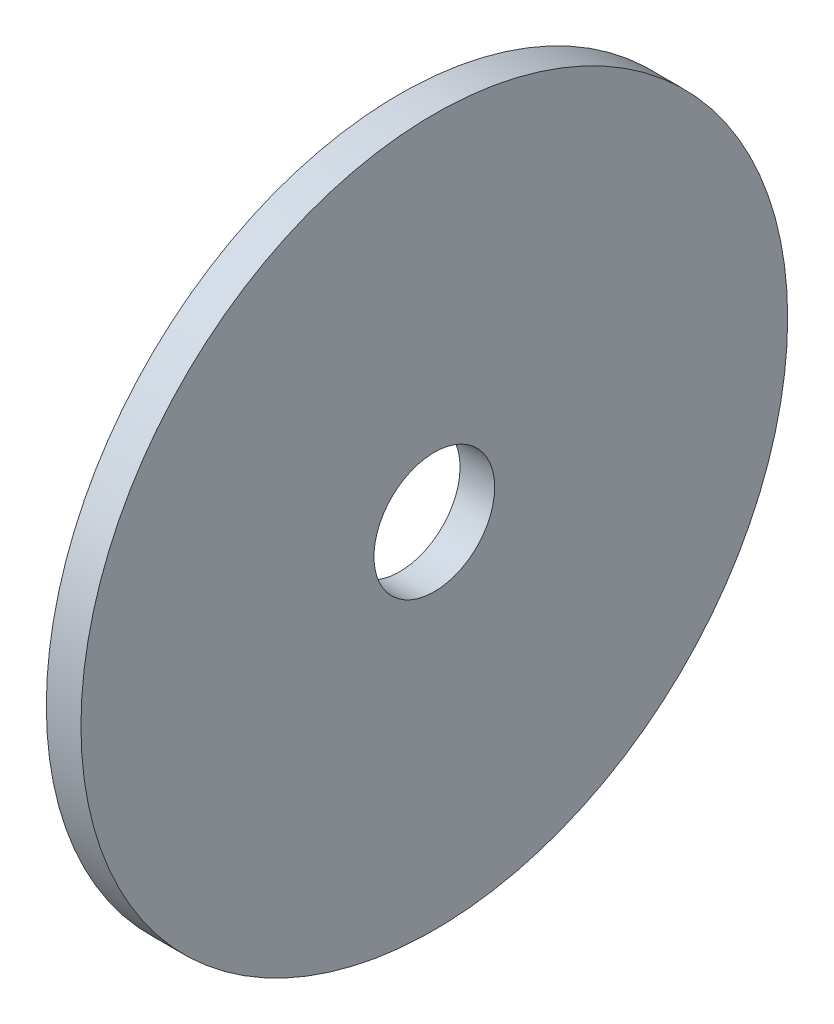
ISO-10303-21;
HEADER;
FILE_DESCRIPTION(('STEP AP214'),'2;1');
FILE_NAME('part.step','',(''),(''),'','','');
FILE_SCHEMA(('AUTOMOTIVE_DESIGN { 1 0 10303 214 1 1 1 1 }'));
ENDSEC;
DATA;
#1=APPLICATION_CONTEXT('core data for automotive mechanical design processes');
#2=APPLICATION_PROTOCOL_DEFINITION('international standard','automotive_design',2000,#1);
#3=PRODUCT_CONTEXT('',#1,'mechanical');
#4=PRODUCT('Part','Part','',(#3));
#5=PRODUCT_RELATED_PRODUCT_CATEGORY('part','',(#4));
#6=PRODUCT_DEFINITION_FORMATION('','',#4);
#7=PRODUCT_DEFINITION_CONTEXT('part definition',#1,'design');
#8=PRODUCT_DEFINITION('design','',#6,#7);
#9=PRODUCT_DEFINITION_SHAPE('','',#8);
#10=(LENGTH_UNIT() NAMED_UNIT(*) SI_UNIT(.MILLI.,.METRE.));
#11=(NAMED_UNIT(*) PLANE_ANGLE_UNIT() SI_UNIT($,.RADIAN.));
#12=(NAMED_UNIT(*) SI_UNIT($,.STERADIAN.) SOLID_ANGLE_UNIT());
#13=UNCERTAINTY_MEASURE_WITH_UNIT(LENGTH_MEASURE(1.E-05),#10,'distance_accuracy_value','');
#14=(GEOMETRIC_REPRESENTATION_CONTEXT(3) GLOBAL_UNCERTAINTY_ASSIGNED_CONTEXT((#13)) GLOBAL_UNIT_ASSIGNED_CONTEXT((#10,
#11,#12)) REPRESENTATION_CONTEXT('',''));
#15=CARTESIAN_POINT('',(0.,0.,0.));
#16=DIRECTION('',(0.,0.,1.));
#17=DIRECTION('',(1.,0.,0.));
#18=AXIS2_PLACEMENT_3D('',#15,#16,#17);
#19=CARTESIAN_POINT('',(542.417,0.,0.));
#20=DIRECTION('',(1.,0.,0.));
#21=DIRECTION('',(0.,0.,-1.));
#22=AXIS2_PLACEMENT_3D('',#19,#20,#21);
#23=PLANE('',#22);
#24=CARTESIAN_POINT('',(542.417,0.,0.));
#25=DIRECTION('',(1.,0.,0.));
#26=DIRECTION('',(0.,0.,-1.));
#27=AXIS2_PLACEMENT_3D('',#24,#25,#26);
#28=CIRCLE('',#27,9.525);
#29=CARTESIAN_POINT('',(542.417,0.,-9.525));
#30=VERTEX_POINT('',#29);
#31=EDGE_CURVE('E49',#30,#30,#28,.T.);
#32=ORIENTED_EDGE('',*,*,#31,.F.);
#33=EDGE_LOOP('',(#32));
#34=FACE_BOUND('',#33,.T.);
#35=CARTESIAN_POINT('',(542.417,0.,0.));
#36=DIRECTION('',(1.,0.,0.));
#37=DIRECTION('',(0.,0.,-1.));
#38=AXIS2_PLACEMENT_3D('',#35,#36,#37);
#39=CIRCLE('',#38,55.7566922304204);
#40=CARTESIAN_POINT('',(542.417,0.,-55.7566922304204));
#41=VERTEX_POINT('',#40);
#42=EDGE_CURVE('E60',#41,#41,#39,.T.);
#43=ORIENTED_EDGE('',*,*,#42,.T.);
#44=EDGE_LOOP('',(#43));
#45=FACE_BOUND('',#44,.T.);
#46=ADVANCED_FACE('F46',(#34,#45),#23,.T.);
#47=CARTESIAN_POINT('',(536.956,0.,0.));
#48=DIRECTION('',(1.,0.,0.));
#49=DIRECTION('',(0.,0.,-1.));
#50=AXIS2_PLACEMENT_3D('',#47,#48,#49);
#51=CYLINDRICAL_SURFACE('',#50,55.7566922304204);
#52=CARTESIAN_POINT('',(536.956,0.,0.));
#53=DIRECTION('',(1.,0.,0.));
#54=DIRECTION('',(0.,0.,-1.));
#55=AXIS2_PLACEMENT_3D('',#52,#53,#54);
#56=CIRCLE('',#55,55.7566922304204);
#57=CARTESIAN_POINT('',(536.956,0.,-55.7566922304204));
#58=VERTEX_POINT('',#57);
#59=EDGE_CURVE('E58',#58,#58,#56,.T.);
#60=ORIENTED_EDGE('',*,*,#59,.T.);
#61=EDGE_LOOP('',(#60));
#62=FACE_BOUND('',#61,.T.);
#63=ORIENTED_EDGE('',*,*,#42,.F.);
#64=EDGE_LOOP('',(#63));
#65=FACE_BOUND('',#64,.T.);
#66=ADVANCED_FACE('F68',(#62,#65),#51,.T.);
#67=CARTESIAN_POINT('',(536.956,0.,0.));
#68=DIRECTION('',(1.,0.,0.));
#69=DIRECTION('',(0.,0.,-1.));
#70=AXIS2_PLACEMENT_3D('',#67,#68,#69);
#71=CYLINDRICAL_SURFACE('',#70,9.525);
#72=CARTESIAN_POINT('',(536.956,0.,0.));
#73=DIRECTION('',(1.,0.,0.));
#74=DIRECTION('',(0.,0.,-1.));
#75=AXIS2_PLACEMENT_3D('',#72,#73,#74);
#76=CIRCLE('',#75,9.525);
#77=CARTESIAN_POINT('',(536.956,0.,-9.525));
#78=VERTEX_POINT('',#77);
#79=EDGE_CURVE('E11',#78,#78,#76,.T.);
#80=ORIENTED_EDGE('',*,*,#79,.F.);
#81=EDGE_LOOP('',(#80));
#82=FACE_BOUND('',#81,.T.);
#83=ORIENTED_EDGE('',*,*,#31,.T.);
#84=EDGE_LOOP('',(#83));
#85=FACE_BOUND('',#84,.T.);
#86=ADVANCED_FACE('F73',(#82,#85),#71,.F.);
#87=CARTESIAN_POINT('',(536.956,0.,0.));
#88=DIRECTION('',(1.,0.,0.));
#89=DIRECTION('',(0.,0.,-1.));
#90=AXIS2_PLACEMENT_3D('',#87,#88,#89);
#91=PLANE('',#90);
#92=ORIENTED_EDGE('',*,*,#79,.T.);
#93=EDGE_LOOP('',(#92));
#94=FACE_BOUND('',#93,.T.);
#95=ORIENTED_EDGE('',*,*,#59,.F.);
#96=EDGE_LOOP('',(#95));
#97=FACE_BOUND('',#96,.T.);
#98=ADVANCED_FACE('F71',(#94,#97),#91,.F.);
#99=CLOSED_SHELL('',(#46,#66,#86,#98));
#100=MANIFOLD_SOLID_BREP('B2',#99);
#101=ADVANCED_BREP_SHAPE_REPRESENTATION('',(#18,#100),#14);
#102=SHAPE_DEFINITION_REPRESENTATION(#9,#101);
ENDSEC;
END-ISO-10303-21;
